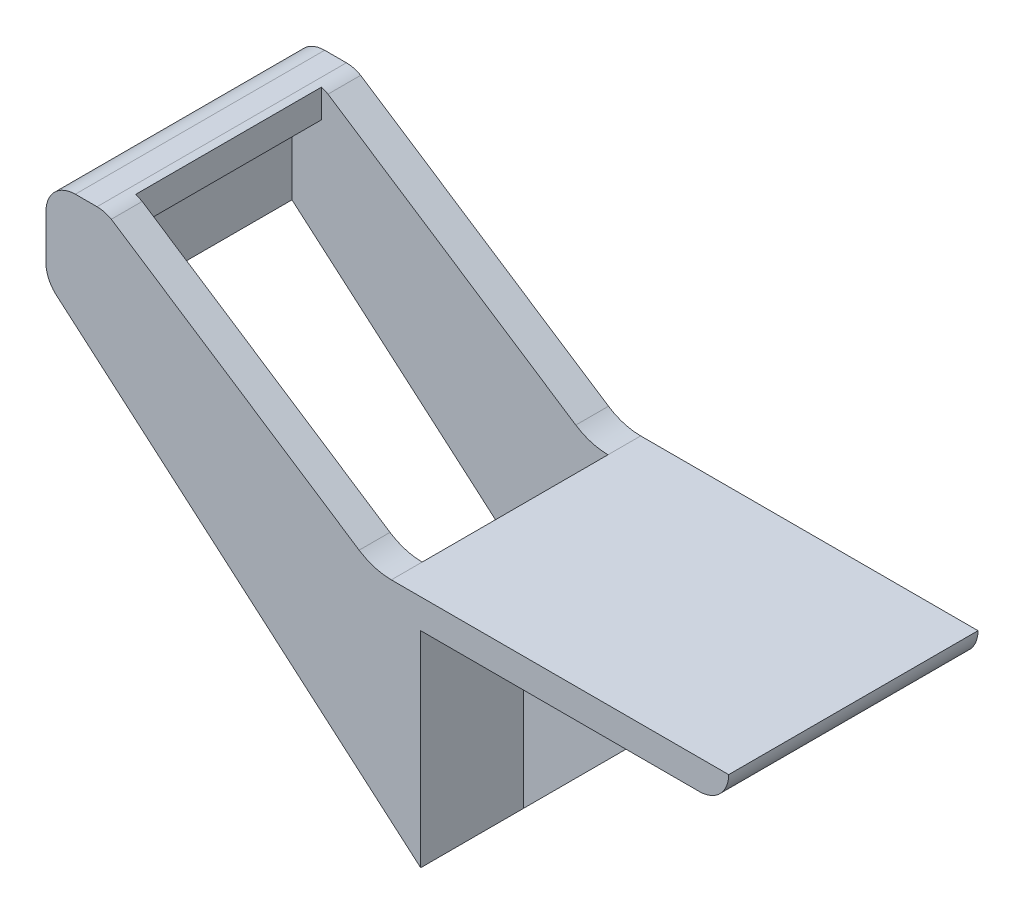
ISO-10303-21;
HEADER;
FILE_DESCRIPTION(('STEP AP214'),'2;1');
FILE_NAME('part.step','',(''),(''),'','','');
FILE_SCHEMA(('AUTOMOTIVE_DESIGN { 1 0 10303 214 1 1 1 1 }'));
ENDSEC;
DATA;
#1=APPLICATION_CONTEXT('core data for automotive mechanical design processes');
#2=APPLICATION_PROTOCOL_DEFINITION('international standard','automotive_design',2000,#1);
#3=PRODUCT_CONTEXT('',#1,'mechanical');
#4=PRODUCT('Part','Part','',(#3));
#5=PRODUCT_RELATED_PRODUCT_CATEGORY('part','',(#4));
#6=PRODUCT_DEFINITION_FORMATION('','',#4);
#7=PRODUCT_DEFINITION_CONTEXT('part definition',#1,'design');
#8=PRODUCT_DEFINITION('design','',#6,#7);
#9=PRODUCT_DEFINITION_SHAPE('','',#8);
#10=(LENGTH_UNIT() NAMED_UNIT(*) SI_UNIT(.MILLI.,.METRE.));
#11=(NAMED_UNIT(*) PLANE_ANGLE_UNIT() SI_UNIT($,.RADIAN.));
#12=(NAMED_UNIT(*) SI_UNIT($,.STERADIAN.) SOLID_ANGLE_UNIT());
#13=UNCERTAINTY_MEASURE_WITH_UNIT(LENGTH_MEASURE(1.E-05),#10,'distance_accuracy_value','');
#14=(GEOMETRIC_REPRESENTATION_CONTEXT(3) GLOBAL_UNCERTAINTY_ASSIGNED_CONTEXT((#13)) GLOBAL_UNIT_ASSIGNED_CONTEXT((#10,
#11,#12)) REPRESENTATION_CONTEXT('',''));
#15=CARTESIAN_POINT('',(0.,0.,0.));
#16=DIRECTION('',(0.,0.,1.));
#17=DIRECTION('',(1.,0.,0.));
#18=AXIS2_PLACEMENT_3D('',#15,#16,#17);
#19=CARTESIAN_POINT('',(0.,-6.35,26.9875));
#20=DIRECTION('',(1.,0.,0.));
#21=DIRECTION('',(0.,1.,0.));
#22=AXIS2_PLACEMENT_3D('',#19,#20,#21);
#23=PLANE('',#22);
#24=DIRECTION('',(0.,0.,-1.));
#25=VECTOR('',#24,1.);
#26=CARTESIAN_POINT('',(0.,-50.8,26.9875));
#27=LINE('',#26,#25);
#28=CARTESIAN_POINT('',(0.,-50.8,26.9875));
#29=VERTEX_POINT('',#28);
#30=CARTESIAN_POINT('',(0.,-50.8,4.7625));
#31=VERTEX_POINT('',#30);
#32=EDGE_CURVE('E343',#29,#31,#27,.T.);
#33=ORIENTED_EDGE('',*,*,#32,.T.);
#34=DIRECTION('',(0.,-1.,0.));
#35=VECTOR('',#34,1.);
#36=CARTESIAN_POINT('',(0.,-6.35,4.7625));
#37=LINE('',#36,#35);
#38=CARTESIAN_POINT('',(0.,-6.35,4.7625));
#39=VERTEX_POINT('',#38);
#40=EDGE_CURVE('E209',#39,#31,#37,.T.);
#41=ORIENTED_EDGE('',*,*,#40,.F.);
#42=DIRECTION('',(0.,0.,-1.));
#43=VECTOR('',#42,1.);
#44=CARTESIAN_POINT('',(0.,-6.35,26.9875));
#45=LINE('',#44,#43);
#46=CARTESIAN_POINT('',(0.,-6.35,26.9875));
#47=VERTEX_POINT('',#46);
#48=EDGE_CURVE('E346',#47,#39,#45,.T.);
#49=ORIENTED_EDGE('',*,*,#48,.F.);
#50=DIRECTION('',(0.,-1.,0.));
#51=VECTOR('',#50,1.);
#52=CARTESIAN_POINT('',(0.,-6.35,26.9875));
#53=LINE('',#52,#51);
#54=EDGE_CURVE('E284',#47,#29,#53,.T.);
#55=ORIENTED_EDGE('',*,*,#54,.T.);
#56=EDGE_LOOP('',(#33,#41,#49,#55));
#57=FACE_BOUND('',#56,.T.);
#58=ADVANCED_FACE('F35',(#57),#23,.T.);
#59=CARTESIAN_POINT('',(60.325,-6.35,26.9875));
#60=DIRECTION('',(0.,-1.,0.));
#61=DIRECTION('',(0.,0.,-1.));
#62=AXIS2_PLACEMENT_3D('',#59,#60,#61);
#63=PLANE('',#62);
#64=ORIENTED_EDGE('',*,*,#48,.T.);
#65=DIRECTION('',(-1.,0.,0.));
#66=VECTOR('',#65,1.);
#67=CARTESIAN_POINT('',(44.4499999999995,-6.35,4.7625));
#68=LINE('',#67,#66);
#69=CARTESIAN_POINT('',(44.4499999999995,-6.35,4.7625));
#70=VERTEX_POINT('',#69);
#71=EDGE_CURVE('E198',#70,#39,#68,.T.);
#72=ORIENTED_EDGE('',*,*,#71,.F.);
#73=DIRECTION('',(0.,0.,-1.));
#74=VECTOR('',#73,1.);
#75=CARTESIAN_POINT('',(44.4499999999995,-6.35,4.7625));
#76=LINE('',#75,#74);
#77=CARTESIAN_POINT('',(44.4499999999995,-6.35,-4.7625));
#78=VERTEX_POINT('',#77);
#79=EDGE_CURVE('E191',#70,#78,#76,.T.);
#80=ORIENTED_EDGE('',*,*,#79,.T.);
#81=DIRECTION('',(-1.,0.,0.));
#82=VECTOR('',#81,1.);
#83=CARTESIAN_POINT('',(44.4499999999995,-6.35,-4.7625));
#84=LINE('',#83,#82);
#85=CARTESIAN_POINT('',(0.,-6.35,-4.7625));
#86=VERTEX_POINT('',#85);
#87=EDGE_CURVE('E196',#78,#86,#84,.T.);
#88=ORIENTED_EDGE('',*,*,#87,.T.);
#89=CARTESIAN_POINT('',(0.,-6.35,-26.9875));
#90=VERTEX_POINT('',#89);
#91=EDGE_CURVE('E348',#86,#90,#45,.T.);
#92=ORIENTED_EDGE('',*,*,#91,.T.);
#93=DIRECTION('',(-1.,0.,0.));
#94=VECTOR('',#93,1.);
#95=CARTESIAN_POINT('',(60.325,-6.35,-26.9875));
#96=LINE('',#95,#94);
#97=CARTESIAN_POINT('',(60.325,-6.35,-26.9875));
#98=VERTEX_POINT('',#97);
#99=EDGE_CURVE('E312',#98,#90,#96,.T.);
#100=ORIENTED_EDGE('',*,*,#99,.F.);
#101=DIRECTION('',(0.,0.,-1.));
#102=VECTOR('',#101,1.);
#103=CARTESIAN_POINT('',(60.325,-6.35,26.9875));
#104=LINE('',#103,#102);
#105=CARTESIAN_POINT('',(60.325,-6.35,26.9875));
#106=VERTEX_POINT('',#105);
#107=EDGE_CURVE('E349',#106,#98,#104,.T.);
#108=ORIENTED_EDGE('',*,*,#107,.F.);
#109=DIRECTION('',(-1.,0.,0.));
#110=VECTOR('',#109,1.);
#111=CARTESIAN_POINT('',(60.325,-6.35,26.9875));
#112=LINE('',#111,#110);
#113=EDGE_CURVE('E281',#106,#47,#112,.T.);
#114=ORIENTED_EDGE('',*,*,#113,.T.);
#115=EDGE_LOOP('',(#64,#72,#80,#88,#92,#100,#108,#114));
#116=FACE_BOUND('',#115,.T.);
#117=ADVANCED_FACE('F194',(#116),#63,.T.);
#118=CARTESIAN_POINT('',(-78.9053255398063,17.1499853763291,26.9875));
#119=DIRECTION('',(0.65254371920983,0.757751076884621,0.));
#120=DIRECTION('',(-0.757751076884621,0.65254371920983,0.));
#121=AXIS2_PLACEMENT_3D('',#118,#119,#120);
#122=PLANE('',#121);
#123=DIRECTION('',(0.757751076884621,-0.65254371920983,0.));
#124=VECTOR('',#123,1.);
#125=CARTESIAN_POINT('',(-78.9053255398063,17.1499853763291,-26.9875));
#126=LINE('',#125,#124);
#127=CARTESIAN_POINT('',(-78.9053255398063,17.1499853763291,-26.9875));
#128=VERTEX_POINT('',#127);
#129=CARTESIAN_POINT('',(0.,-50.8,-26.9875));
#130=VERTEX_POINT('',#129);
#131=EDGE_CURVE('E318',#128,#130,#126,.T.);
#132=ORIENTED_EDGE('',*,*,#131,.T.);
#133=CARTESIAN_POINT('',(0.,-50.8,-4.7625));
#134=VERTEX_POINT('',#133);
#135=EDGE_CURVE('E345',#134,#130,#27,.T.);
#136=ORIENTED_EDGE('',*,*,#135,.F.);
#137=DIRECTION('',(0.,0.,-1.));
#138=VECTOR('',#137,1.);
#139=CARTESIAN_POINT('',(0.,-50.8,4.7625));
#140=LINE('',#139,#138);
#141=EDGE_CURVE('E57',#31,#134,#140,.T.);
#142=ORIENTED_EDGE('',*,*,#141,.F.);
#143=ORIENTED_EDGE('',*,*,#32,.F.);
#144=DIRECTION('',(0.757751076884621,-0.65254371920983,0.));
#145=VECTOR('',#144,1.);
#146=CARTESIAN_POINT('',(-78.9053255398063,17.1499853763291,26.9875));
#147=LINE('',#146,#145);
#148=CARTESIAN_POINT('',(-78.9053255398063,17.1499853763291,26.9875));
#149=VERTEX_POINT('',#148);
#150=EDGE_CURVE('E287',#149,#29,#147,.T.);
#151=ORIENTED_EDGE('',*,*,#150,.F.);
#152=DIRECTION('',(0.,0.,-1.));
#153=VECTOR('',#152,1.);
#154=CARTESIAN_POINT('',(-78.9053255398063,17.1499853763291,26.9875));
#155=LINE('',#154,#153);
#156=EDGE_CURVE('E340',#149,#128,#155,.T.);
#157=ORIENTED_EDGE('',*,*,#156,.T.);
#158=EDGE_LOOP('',(#132,#136,#142,#143,#151,#157));
#159=FACE_BOUND('',#158,.T.);
#160=DIRECTION('',(0.,0.,-1.));
#161=VECTOR('',#160,1.);
#162=CARTESIAN_POINT('',(-74.7616729228239,13.5816440406546,26.9875));
#163=LINE('',#162,#161);
#164=CARTESIAN_POINT('',(-74.7616729228239,13.5816440406546,20.3088969459393));
#165=VERTEX_POINT('',#164);
#166=CARTESIAN_POINT('',(-74.7616729228239,13.5816440406546,-19.9170854292975));
#167=VERTEX_POINT('',#166);
#168=EDGE_CURVE('E12',#165,#167,#163,.T.);
#169=ORIENTED_EDGE('',*,*,#168,.F.);
#170=DIRECTION('',(-0.757751076884621,0.65254371920983,0.));
#171=VECTOR('',#170,1.);
#172=CARTESIAN_POINT('',(-78.9053255398063,17.1499853763291,20.3088969459393));
#173=LINE('',#172,#171);
#174=CARTESIAN_POINT('',(-6.35000000000001,-45.3316440406546,20.3088969459393));
#175=VERTEX_POINT('',#174);
#176=EDGE_CURVE('E250',#175,#165,#173,.T.);
#177=ORIENTED_EDGE('',*,*,#176,.F.);
#178=DIRECTION('',(0.,0.,1.));
#179=VECTOR('',#178,1.);
#180=CARTESIAN_POINT('',(-6.34999999999999,-45.3316440406546,26.9875));
#181=LINE('',#180,#179);
#182=CARTESIAN_POINT('',(-6.35,-45.3316440406546,-19.9170854292975));
#183=VERTEX_POINT('',#182);
#184=EDGE_CURVE('E260',#183,#175,#181,.T.);
#185=ORIENTED_EDGE('',*,*,#184,.F.);
#186=DIRECTION('',(0.757751076884621,-0.65254371920983,0.));
#187=VECTOR('',#186,1.);
#188=CARTESIAN_POINT('',(-78.9053255398063,17.1499853763291,-19.9170854292975));
#189=LINE('',#188,#187);
#190=EDGE_CURVE('E258',#167,#183,#189,.T.);
#191=ORIENTED_EDGE('',*,*,#190,.F.);
#192=EDGE_LOOP('',(#169,#177,#185,#191));
#193=FACE_BOUND('',#192,.T.);
#194=ADVANCED_FACE('F403',(#159,#193),#122,.F.);
#195=CARTESIAN_POINT('',(-68.4116729228239,38.1,-19.9170854292975));
#196=DIRECTION('',(1.,0.,0.));
#197=DIRECTION('',(0.,0.,-1.));
#198=AXIS2_PLACEMENT_3D('',#195,#196,#197);
#199=PLANE('',#198);
#200=DIRECTION('',(0.,-1.,0.));
#201=VECTOR('',#200,1.);
#202=CARTESIAN_POINT('',(-68.4116729228239,38.1,20.3088969459393));
#203=LINE('',#202,#201);
#204=CARTESIAN_POINT('',(-68.4116729228239,37.8821561526516,20.3088969459393));
#205=VERTEX_POINT('',#204);
#206=CARTESIAN_POINT('',(-68.4116729228239,31.75,20.3088969459393));
#207=VERTEX_POINT('',#206);
#208=EDGE_CURVE('E235',#205,#207,#203,.T.);
#209=ORIENTED_EDGE('',*,*,#208,.T.);
#210=DIRECTION('',(0.,0.,1.));
#211=VECTOR('',#210,1.);
#212=CARTESIAN_POINT('',(-68.4116729228239,31.75,-19.9170854292975));
#213=LINE('',#212,#211);
#214=CARTESIAN_POINT('',(-68.4116729228239,31.75,-19.9170854292975));
#215=VERTEX_POINT('',#214);
#216=EDGE_CURVE('E224',#215,#207,#213,.T.);
#217=ORIENTED_EDGE('',*,*,#216,.F.);
#218=DIRECTION('',(0.,-1.,0.));
#219=VECTOR('',#218,1.);
#220=CARTESIAN_POINT('',(-68.4116729228239,38.1,-19.9170854292975));
#221=LINE('',#220,#219);
#222=CARTESIAN_POINT('',(-68.4116729228239,37.8821561526516,-19.9170854292975));
#223=VERTEX_POINT('',#222);
#224=EDGE_CURVE('E238',#223,#215,#221,.T.);
#225=ORIENTED_EDGE('',*,*,#224,.F.);
#226=DIRECTION('',(0.,0.,-1.));
#227=VECTOR('',#226,1.);
#228=CARTESIAN_POINT('',(-68.4116729228239,37.8821561526516,26.9875));
#229=LINE('',#228,#227);
#230=EDGE_CURVE('E263',#205,#223,#229,.T.);
#231=ORIENTED_EDGE('',*,*,#230,.F.);
#232=EDGE_LOOP('',(#209,#217,#225,#231));
#233=FACE_BOUND('',#232,.T.);
#234=ADVANCED_FACE('F389',(#233),#199,.T.);
#235=CARTESIAN_POINT('',(-70.0606607698069,31.75,26.9875));
#236=DIRECTION('',(0.,0.,-1.));
#237=DIRECTION('',(-1.,0.,0.));
#238=AXIS2_PLACEMENT_3D('',#235,#236,#237);
#239=CYLINDRICAL_SURFACE('',#238,6.35);
#240=ORIENTED_EDGE('',*,*,#230,.T.);
#241=CARTESIAN_POINT('',(-70.0606607698069,31.75,-19.9170854292975));
#242=DIRECTION('',(0.,0.,1.));
#243=DIRECTION('',(1.,0.,0.));
#244=AXIS2_PLACEMENT_3D('',#241,#242,#243);
#245=CIRCLE('',#244,6.35);
#246=CARTESIAN_POINT('',(-66.9710349961021,37.2976763224308,-19.9170854292975));
#247=VERTEX_POINT('',#246);
#248=EDGE_CURVE('E255',#223,#247,#245,.F.);
#249=ORIENTED_EDGE('',*,*,#248,.T.);
#250=DIRECTION('',(0.,0.,-1.));
#251=VECTOR('',#250,1.);
#252=CARTESIAN_POINT('',(-66.9710349961021,37.2976763224308,26.9875));
#253=LINE('',#252,#251);
#254=CARTESIAN_POINT('',(-66.9710349961021,37.2976763224308,-26.9875));
#255=VERTEX_POINT('',#254);
#256=EDGE_CURVE('E298',#247,#255,#253,.T.);
#257=ORIENTED_EDGE('',*,*,#256,.T.);
#258=CARTESIAN_POINT('',(-70.0606607698069,31.75,-26.9875));
#259=DIRECTION('',(0.,0.,-1.));
#260=DIRECTION('',(-1.,0.,0.));
#261=AXIS2_PLACEMENT_3D('',#258,#259,#260);
#262=CIRCLE('',#261,6.35);
#263=CARTESIAN_POINT('',(-70.0606607698069,38.1,-26.9875));
#264=VERTEX_POINT('',#263);
#265=EDGE_CURVE('E266',#264,#255,#262,.T.);
#266=ORIENTED_EDGE('',*,*,#265,.F.);
#267=DIRECTION('',(0.,0.,-1.));
#268=VECTOR('',#267,1.);
#269=CARTESIAN_POINT('',(-70.0606607698069,38.1,26.9875));
#270=LINE('',#269,#268);
#271=CARTESIAN_POINT('',(-70.0606607698069,38.1,26.9875));
#272=VERTEX_POINT('',#271);
#273=EDGE_CURVE('E330',#272,#264,#270,.T.);
#274=ORIENTED_EDGE('',*,*,#273,.F.);
#275=CARTESIAN_POINT('',(-70.0606607698069,31.75,26.9875));
#276=DIRECTION('',(0.,0.,-1.));
#277=DIRECTION('',(-1.,0.,0.));
#278=AXIS2_PLACEMENT_3D('',#275,#276,#277);
#279=CIRCLE('',#278,6.35);
#280=CARTESIAN_POINT('',(-66.9710349961021,37.2976763224308,26.9875));
#281=VERTEX_POINT('',#280);
#282=EDGE_CURVE('E267',#272,#281,#279,.T.);
#283=ORIENTED_EDGE('',*,*,#282,.T.);
#284=CARTESIAN_POINT('',(-66.9710349961021,37.2976763224308,20.3088969459393));
#285=VERTEX_POINT('',#284);
#286=EDGE_CURVE('E363',#281,#285,#253,.T.);
#287=ORIENTED_EDGE('',*,*,#286,.T.);
#288=CARTESIAN_POINT('',(-70.0606607698069,31.75,20.3088969459393));
#289=DIRECTION('',(0.,0.,-1.));
#290=DIRECTION('',(-1.,0.,0.));
#291=AXIS2_PLACEMENT_3D('',#288,#289,#290);
#292=CIRCLE('',#291,6.35);
#293=EDGE_CURVE('E247',#285,#205,#292,.F.);
#294=ORIENTED_EDGE('',*,*,#293,.T.);
#295=EDGE_LOOP('',(#240,#249,#257,#266,#274,#283,#287,#294));
#296=FACE_BOUND('',#295,.T.);
#297=ADVANCED_FACE('F37',(#296),#239,.T.);
#298=CARTESIAN_POINT('',(-6.34999999999999,12.7,26.9875));
#299=DIRECTION('',(0.,0.,-1.));
#300=DIRECTION('',(-1.,0.,0.));
#301=AXIS2_PLACEMENT_3D('',#298,#299,#300);
#302=CYLINDRICAL_SURFACE('',#301,12.7);
#303=DIRECTION('',(0.,0.,-1.));
#304=VECTOR('',#303,1.);
#305=CARTESIAN_POINT('',(-13.3187167882357,2.08270343612074,26.9875));
#306=LINE('',#305,#304);
#307=CARTESIAN_POINT('',(-13.3187167882357,2.08270343612074,-19.9170854292975));
#308=VERTEX_POINT('',#307);
#309=CARTESIAN_POINT('',(-13.3187167882357,2.08270343612074,-26.9875));
#310=VERTEX_POINT('',#309);
#311=EDGE_CURVE('E362',#308,#310,#306,.T.);
#312=ORIENTED_EDGE('',*,*,#311,.F.);
#313=CARTESIAN_POINT('',(-6.34999999999999,12.7,-19.9170854292975));
#314=DIRECTION('',(0.,0.,1.));
#315=DIRECTION('',(1.,0.,0.));
#316=AXIS2_PLACEMENT_3D('',#313,#314,#315);
#317=CIRCLE('',#316,12.7);
#318=CARTESIAN_POINT('',(-6.34999999999999,0.,-19.9170854292975));
#319=VERTEX_POINT('',#318);
#320=EDGE_CURVE('E252',#308,#319,#317,.T.);
#321=ORIENTED_EDGE('',*,*,#320,.T.);
#322=DIRECTION('',(0.,0.,-1.));
#323=VECTOR('',#322,1.);
#324=CARTESIAN_POINT('',(-6.35,0.,26.9875));
#325=LINE('',#324,#323);
#326=CARTESIAN_POINT('',(-6.35,0.,-26.9875));
#327=VERTEX_POINT('',#326);
#328=EDGE_CURVE('E358',#319,#327,#325,.T.);
#329=ORIENTED_EDGE('',*,*,#328,.T.);
#330=CARTESIAN_POINT('',(-6.34999999999999,12.7,-26.9875));
#331=DIRECTION('',(0.,0.,1.));
#332=DIRECTION('',(1.,0.,0.));
#333=AXIS2_PLACEMENT_3D('',#330,#331,#332);
#334=CIRCLE('',#333,12.7);
#335=EDGE_CURVE('E304',#310,#327,#334,.T.);
#336=ORIENTED_EDGE('',*,*,#335,.F.);
#337=EDGE_LOOP('',(#312,#321,#329,#336));
#338=FACE_BOUND('',#337,.T.);
#339=ADVANCED_FACE('F376',(#338),#302,.F.);
#340=CARTESIAN_POINT('',(-6.35,0.,26.9875));
#341=VERTEX_POINT('',#340);
#342=CARTESIAN_POINT('',(-6.34999999999999,0.,20.3088969459393));
#343=VERTEX_POINT('',#342);
#344=EDGE_CURVE('E354',#341,#343,#325,.T.);
#345=ORIENTED_EDGE('',*,*,#344,.T.);
#346=CARTESIAN_POINT('',(-6.34999999999999,12.7,20.3088969459393));
#347=DIRECTION('',(0.,0.,-1.));
#348=DIRECTION('',(-1.,0.,0.));
#349=AXIS2_PLACEMENT_3D('',#346,#347,#348);
#350=CIRCLE('',#349,12.7);
#351=CARTESIAN_POINT('',(-13.3187167882357,2.08270343612074,20.3088969459393));
#352=VERTEX_POINT('',#351);
#353=EDGE_CURVE('E244',#343,#352,#350,.T.);
#354=ORIENTED_EDGE('',*,*,#353,.T.);
#355=CARTESIAN_POINT('',(-13.3187167882357,2.08270343612074,26.9875));
#356=VERTEX_POINT('',#355);
#357=EDGE_CURVE('E359',#356,#352,#306,.T.);
#358=ORIENTED_EDGE('',*,*,#357,.F.);
#359=CARTESIAN_POINT('',(-6.34999999999999,12.7,26.9875));
#360=DIRECTION('',(0.,0.,1.));
#361=DIRECTION('',(1.,0.,0.));
#362=AXIS2_PLACEMENT_3D('',#359,#360,#361);
#363=CIRCLE('',#362,12.7);
#364=EDGE_CURVE('E274',#356,#341,#363,.T.);
#365=ORIENTED_EDGE('',*,*,#364,.T.);
#366=EDGE_LOOP('',(#345,#354,#358,#365));
#367=FACE_BOUND('',#366,.T.);
#368=ADVANCED_FACE('F415',(#367),#302,.F.);
#369=CARTESIAN_POINT('',(-66.9710349961021,37.2976763224308,26.9875));
#370=DIRECTION('',(0.548717857341391,0.83600760345506,0.));
#371=DIRECTION('',(-0.83600760345506,0.548717857341391,0.));
#372=AXIS2_PLACEMENT_3D('',#369,#370,#371);
#373=PLANE('',#372);
#374=ORIENTED_EDGE('',*,*,#256,.F.);
#375=DIRECTION('',(0.83600760345506,-0.548717857341391,0.));
#376=VECTOR('',#375,1.);
#377=CARTESIAN_POINT('',(-66.9710349961021,37.2976763224308,-19.9170854292975));
#378=LINE('',#377,#376);
#379=EDGE_CURVE('E43',#247,#308,#378,.T.);
#380=ORIENTED_EDGE('',*,*,#379,.T.);
#381=ORIENTED_EDGE('',*,*,#311,.T.);
#382=DIRECTION('',(0.83600760345506,-0.548717857341391,0.));
#383=VECTOR('',#382,1.);
#384=CARTESIAN_POINT('',(-66.9710349961021,37.2976763224308,-26.9875));
#385=LINE('',#384,#383);
#386=EDGE_CURVE('E301',#255,#310,#385,.T.);
#387=ORIENTED_EDGE('',*,*,#386,.F.);
#388=EDGE_LOOP('',(#374,#380,#381,#387));
#389=FACE_BOUND('',#388,.T.);
#390=ADVANCED_FACE('F371',(#389),#373,.T.);
#391=ORIENTED_EDGE('',*,*,#357,.T.);
#392=DIRECTION('',(-0.83600760345506,0.548717857341391,0.));
#393=VECTOR('',#392,1.);
#394=CARTESIAN_POINT('',(-66.9710349961021,37.2976763224308,20.3088969459393));
#395=LINE('',#394,#393);
#396=EDGE_CURVE('E332',#352,#285,#395,.T.);
#397=ORIENTED_EDGE('',*,*,#396,.T.);
#398=ORIENTED_EDGE('',*,*,#286,.F.);
#399=DIRECTION('',(0.83600760345506,-0.548717857341391,0.));
#400=VECTOR('',#399,1.);
#401=CARTESIAN_POINT('',(-66.9710349961021,37.2976763224308,26.9875));
#402=LINE('',#401,#400);
#403=EDGE_CURVE('E270',#281,#356,#402,.T.);
#404=ORIENTED_EDGE('',*,*,#403,.T.);
#405=EDGE_LOOP('',(#391,#397,#398,#404));
#406=FACE_BOUND('',#405,.T.);
#407=ADVANCED_FACE('F422',(#406),#373,.T.);
#408=CARTESIAN_POINT('',(-70.0606607698069,38.1,26.9875));
#409=DIRECTION('',(0.,-1.,0.));
#410=DIRECTION('',(0.,0.,-1.));
#411=AXIS2_PLACEMENT_3D('',#408,#409,#410);
#412=PLANE('',#411);
#413=DIRECTION('',(-1.,0.,0.));
#414=VECTOR('',#413,1.);
#415=CARTESIAN_POINT('',(-70.0606607698069,38.1,-26.9875));
#416=LINE('',#415,#414);
#417=CARTESIAN_POINT('',(-74.7616729228239,38.1,-26.9875));
#418=VERTEX_POINT('',#417);
#419=EDGE_CURVE('E271',#264,#418,#416,.T.);
#420=ORIENTED_EDGE('',*,*,#419,.T.);
#421=DIRECTION('',(0.,0.,-1.));
#422=VECTOR('',#421,1.);
#423=CARTESIAN_POINT('',(-74.7616729228239,38.1,26.9875));
#424=LINE('',#423,#422);
#425=CARTESIAN_POINT('',(-74.7616729228239,38.1,26.9875));
#426=VERTEX_POINT('',#425);
#427=EDGE_CURVE('E333',#426,#418,#424,.T.);
#428=ORIENTED_EDGE('',*,*,#427,.F.);
#429=DIRECTION('',(-1.,0.,0.));
#430=VECTOR('',#429,1.);
#431=CARTESIAN_POINT('',(-70.0606607698069,38.1,26.9875));
#432=LINE('',#431,#430);
#433=EDGE_CURVE('E296',#272,#426,#432,.T.);
#434=ORIENTED_EDGE('',*,*,#433,.F.);
#435=ORIENTED_EDGE('',*,*,#273,.T.);
#436=EDGE_LOOP('',(#420,#428,#434,#435));
#437=FACE_BOUND('',#436,.T.);
#438=ADVANCED_FACE('F426',(#437),#412,.F.);
#439=CARTESIAN_POINT('',(-74.7616729228239,31.75,26.9875));
#440=DIRECTION('',(0.,0.,-1.));
#441=DIRECTION('',(-1.,0.,0.));
#442=AXIS2_PLACEMENT_3D('',#439,#440,#441);
#443=CYLINDRICAL_SURFACE('',#442,6.35);
#444=CARTESIAN_POINT('',(-74.7616729228239,31.75,-26.9875));
#445=DIRECTION('',(0.,0.,-1.));
#446=DIRECTION('',(-1.,0.,0.));
#447=AXIS2_PLACEMENT_3D('',#444,#445,#446);
#448=CIRCLE('',#447,6.35);
#449=CARTESIAN_POINT('',(-81.1116729228239,31.75,-26.9875));
#450=VERTEX_POINT('',#449);
#451=EDGE_CURVE('E325',#450,#418,#448,.T.);
#452=ORIENTED_EDGE('',*,*,#451,.F.);
#453=DIRECTION('',(0.,0.,-1.));
#454=VECTOR('',#453,1.);
#455=CARTESIAN_POINT('',(-81.1116729228239,31.75,26.9875));
#456=LINE('',#455,#454);
#457=CARTESIAN_POINT('',(-81.1116729228239,31.75,26.9875));
#458=VERTEX_POINT('',#457);
#459=EDGE_CURVE('E335',#458,#450,#456,.T.);
#460=ORIENTED_EDGE('',*,*,#459,.F.);
#461=CARTESIAN_POINT('',(-74.7616729228239,31.75,26.9875));
#462=DIRECTION('',(0.,0.,-1.));
#463=DIRECTION('',(-1.,0.,0.));
#464=AXIS2_PLACEMENT_3D('',#461,#462,#463);
#465=CIRCLE('',#464,6.35);
#466=EDGE_CURVE('E293',#458,#426,#465,.T.);
#467=ORIENTED_EDGE('',*,*,#466,.T.);
#468=ORIENTED_EDGE('',*,*,#427,.T.);
#469=EDGE_LOOP('',(#452,#460,#467,#468));
#470=FACE_BOUND('',#469,.T.);
#471=ADVANCED_FACE('F429',(#470),#443,.T.);
#472=CARTESIAN_POINT('',(-81.1116729228239,31.75,26.9875));
#473=DIRECTION('',(1.,0.,0.));
#474=DIRECTION('',(0.,0.,-1.));
#475=AXIS2_PLACEMENT_3D('',#472,#473,#474);
#476=PLANE('',#475);
#477=DIRECTION('',(0.,-1.,0.));
#478=VECTOR('',#477,1.);
#479=CARTESIAN_POINT('',(-81.1116729228239,31.75,-26.9875));
#480=LINE('',#479,#478);
#481=CARTESIAN_POINT('',(-81.1116729228239,21.9617047145464,-26.9875));
#482=VERTEX_POINT('',#481);
#483=EDGE_CURVE('E323',#450,#482,#480,.T.);
#484=ORIENTED_EDGE('',*,*,#483,.T.);
#485=DIRECTION('',(0.,0.,-1.));
#486=VECTOR('',#485,1.);
#487=CARTESIAN_POINT('',(-81.1116729228239,21.9617047145464,26.9875));
#488=LINE('',#487,#486);
#489=CARTESIAN_POINT('',(-81.1116729228239,21.9617047145464,26.9875));
#490=VERTEX_POINT('',#489);
#491=EDGE_CURVE('E337',#490,#482,#488,.T.);
#492=ORIENTED_EDGE('',*,*,#491,.F.);
#493=DIRECTION('',(0.,-1.,0.));
#494=VECTOR('',#493,1.);
#495=CARTESIAN_POINT('',(-81.1116729228239,31.75,26.9875));
#496=LINE('',#495,#494);
#497=EDGE_CURVE('E291',#458,#490,#496,.T.);
#498=ORIENTED_EDGE('',*,*,#497,.F.);
#499=ORIENTED_EDGE('',*,*,#459,.T.);
#500=EDGE_LOOP('',(#484,#492,#498,#499));
#501=FACE_BOUND('',#500,.T.);
#502=ADVANCED_FACE('F434',(#501),#476,.F.);
#503=CARTESIAN_POINT('',(-74.7616729228239,21.9617047145464,26.9875));
#504=DIRECTION('',(0.,0.,-1.));
#505=DIRECTION('',(-1.,0.,0.));
#506=AXIS2_PLACEMENT_3D('',#503,#504,#505);
#507=CYLINDRICAL_SURFACE('',#506,6.34999999999999);
#508=CARTESIAN_POINT('',(-74.7616729228239,21.9617047145464,-26.9875));
#509=DIRECTION('',(0.,0.,1.));
#510=DIRECTION('',(1.,0.,0.));
#511=AXIS2_PLACEMENT_3D('',#508,#509,#510);
#512=CIRCLE('',#511,6.34999999999999);
#513=EDGE_CURVE('E321',#482,#128,#512,.T.);
#514=ORIENTED_EDGE('',*,*,#513,.T.);
#515=ORIENTED_EDGE('',*,*,#156,.F.);
#516=CARTESIAN_POINT('',(-74.7616729228239,21.9617047145464,26.9875));
#517=DIRECTION('',(0.,0.,1.));
#518=DIRECTION('',(1.,0.,0.));
#519=AXIS2_PLACEMENT_3D('',#516,#517,#518);
#520=CIRCLE('',#519,6.34999999999999);
#521=EDGE_CURVE('E289',#490,#149,#520,.T.);
#522=ORIENTED_EDGE('',*,*,#521,.F.);
#523=ORIENTED_EDGE('',*,*,#491,.T.);
#524=EDGE_LOOP('',(#514,#515,#522,#523));
#525=FACE_BOUND('',#524,.T.);
#526=ADVANCED_FACE('F440',(#525),#507,.T.);
#527=DIRECTION('',(0.,-1.,0.));
#528=VECTOR('',#527,1.);
#529=CARTESIAN_POINT('',(0.,-6.35,-4.7625));
#530=LINE('',#529,#528);
#531=EDGE_CURVE('E50',#86,#134,#530,.T.);
#532=ORIENTED_EDGE('',*,*,#531,.T.);
#533=ORIENTED_EDGE('',*,*,#135,.T.);
#534=DIRECTION('',(0.,-1.,0.));
#535=VECTOR('',#534,1.);
#536=CARTESIAN_POINT('',(0.,-6.35,-26.9875));
#537=LINE('',#536,#535);
#538=EDGE_CURVE('E315',#90,#130,#537,.T.);
#539=ORIENTED_EDGE('',*,*,#538,.F.);
#540=ORIENTED_EDGE('',*,*,#91,.F.);
#541=EDGE_LOOP('',(#532,#533,#539,#540));
#542=FACE_BOUND('',#541,.T.);
#543=ADVANCED_FACE('F452',(#542),#23,.T.);
#544=CARTESIAN_POINT('',(60.325,0.,26.9875));
#545=DIRECTION('',(0.,0.,-1.));
#546=DIRECTION('',(-1.,0.,0.));
#547=AXIS2_PLACEMENT_3D('',#544,#545,#546);
#548=CYLINDRICAL_SURFACE('',#547,6.35);
#549=CARTESIAN_POINT('',(60.325,0.,-26.9875));
#550=DIRECTION('',(0.,0.,1.));
#551=DIRECTION('',(1.,0.,0.));
#552=AXIS2_PLACEMENT_3D('',#549,#550,#551);
#553=CIRCLE('',#552,6.35);
#554=CARTESIAN_POINT('',(66.675,0.,-26.9875));
#555=VERTEX_POINT('',#554);
#556=EDGE_CURVE('E310',#98,#555,#553,.T.);
#557=ORIENTED_EDGE('',*,*,#556,.T.);
#558=DIRECTION('',(0.,0.,-1.));
#559=VECTOR('',#558,1.);
#560=CARTESIAN_POINT('',(66.675,0.,26.9875));
#561=LINE('',#560,#559);
#562=CARTESIAN_POINT('',(66.675,0.,26.9875));
#563=VERTEX_POINT('',#562);
#564=EDGE_CURVE('E351',#563,#555,#561,.T.);
#565=ORIENTED_EDGE('',*,*,#564,.F.);
#566=CARTESIAN_POINT('',(60.325,0.,26.9875));
#567=DIRECTION('',(0.,0.,1.));
#568=DIRECTION('',(1.,0.,0.));
#569=AXIS2_PLACEMENT_3D('',#566,#567,#568);
#570=CIRCLE('',#569,6.35);
#571=EDGE_CURVE('E279',#106,#563,#570,.T.);
#572=ORIENTED_EDGE('',*,*,#571,.F.);
#573=ORIENTED_EDGE('',*,*,#107,.T.);
#574=EDGE_LOOP('',(#557,#565,#572,#573));
#575=FACE_BOUND('',#574,.T.);
#576=ADVANCED_FACE('F450',(#575),#548,.T.);
#577=CARTESIAN_POINT('',(66.675,0.,26.9875));
#578=DIRECTION('',(0.,-1.,0.));
#579=DIRECTION('',(1.,0.,0.));
#580=AXIS2_PLACEMENT_3D('',#577,#578,#579);
#581=PLANE('',#580);
#582=DIRECTION('',(-1.,0.,0.));
#583=VECTOR('',#582,1.);
#584=CARTESIAN_POINT('',(66.675,0.,-26.9875));
#585=LINE('',#584,#583);
#586=EDGE_CURVE('E307',#555,#327,#585,.T.);
#587=ORIENTED_EDGE('',*,*,#586,.T.);
#588=ORIENTED_EDGE('',*,*,#328,.F.);
#589=EDGE_CURVE('E357',#343,#319,#325,.T.);
#590=ORIENTED_EDGE('',*,*,#589,.F.);
#591=ORIENTED_EDGE('',*,*,#344,.F.);
#592=DIRECTION('',(-1.,0.,0.));
#593=VECTOR('',#592,1.);
#594=CARTESIAN_POINT('',(66.675,0.,26.9875));
#595=LINE('',#594,#593);
#596=EDGE_CURVE('E277',#563,#341,#595,.T.);
#597=ORIENTED_EDGE('',*,*,#596,.F.);
#598=ORIENTED_EDGE('',*,*,#564,.T.);
#599=EDGE_LOOP('',(#587,#588,#590,#591,#597,#598));
#600=FACE_BOUND('',#599,.T.);
#601=ADVANCED_FACE('F412',(#600),#581,.F.);
#602=CARTESIAN_POINT('',(-70.0606607698069,31.75,26.9875));
#603=DIRECTION('',(0.,0.,-1.));
#604=DIRECTION('',(-1.,0.,0.));
#605=AXIS2_PLACEMENT_3D('',#602,#603,#604);
#606=PLANE('',#605);
#607=ORIENTED_EDGE('',*,*,#282,.F.);
#608=ORIENTED_EDGE('',*,*,#433,.T.);
#609=ORIENTED_EDGE('',*,*,#466,.F.);
#610=ORIENTED_EDGE('',*,*,#497,.T.);
#611=ORIENTED_EDGE('',*,*,#521,.T.);
#612=ORIENTED_EDGE('',*,*,#150,.T.);
#613=ORIENTED_EDGE('',*,*,#54,.F.);
#614=ORIENTED_EDGE('',*,*,#113,.F.);
#615=ORIENTED_EDGE('',*,*,#571,.T.);
#616=ORIENTED_EDGE('',*,*,#596,.T.);
#617=ORIENTED_EDGE('',*,*,#364,.F.);
#618=ORIENTED_EDGE('',*,*,#403,.F.);
#619=EDGE_LOOP('',(#607,#608,#609,#610,#611,#612,#613,#614,#615,#616,#617,#618));
#620=FACE_BOUND('',#619,.T.);
#621=ADVANCED_FACE('F420',(#620),#606,.F.);
#622=CARTESIAN_POINT('',(-70.0606607698069,31.75,-26.9875));
#623=DIRECTION('',(0.,0.,-1.));
#624=DIRECTION('',(-1.,0.,0.));
#625=AXIS2_PLACEMENT_3D('',#622,#623,#624);
#626=PLANE('',#625);
#627=ORIENTED_EDGE('',*,*,#265,.T.);
#628=ORIENTED_EDGE('',*,*,#386,.T.);
#629=ORIENTED_EDGE('',*,*,#335,.T.);
#630=ORIENTED_EDGE('',*,*,#586,.F.);
#631=ORIENTED_EDGE('',*,*,#556,.F.);
#632=ORIENTED_EDGE('',*,*,#99,.T.);
#633=ORIENTED_EDGE('',*,*,#538,.T.);
#634=ORIENTED_EDGE('',*,*,#131,.F.);
#635=ORIENTED_EDGE('',*,*,#513,.F.);
#636=ORIENTED_EDGE('',*,*,#483,.F.);
#637=ORIENTED_EDGE('',*,*,#451,.T.);
#638=ORIENTED_EDGE('',*,*,#419,.F.);
#639=EDGE_LOOP('',(#627,#628,#629,#630,#631,#632,#633,#634,#635,#636,#637,#638));
#640=FACE_BOUND('',#639,.T.);
#641=ADVANCED_FACE('F380',(#640),#626,.T.);
#642=CARTESIAN_POINT('',(-6.34999999999999,38.1,-19.9170854292975));
#643=DIRECTION('',(-1.,0.,0.));
#644=DIRECTION('',(0.,0.,1.));
#645=AXIS2_PLACEMENT_3D('',#642,#643,#644);
#646=PLANE('',#645);
#647=ORIENTED_EDGE('',*,*,#184,.T.);
#648=DIRECTION('',(0.,-1.,0.));
#649=VECTOR('',#648,1.);
#650=CARTESIAN_POINT('',(-6.34999999999999,38.1,20.3088969459393));
#651=LINE('',#650,#649);
#652=EDGE_CURVE('E226',#343,#175,#651,.T.);
#653=ORIENTED_EDGE('',*,*,#652,.F.);
#654=ORIENTED_EDGE('',*,*,#589,.T.);
#655=DIRECTION('',(0.,-1.,0.));
#656=VECTOR('',#655,1.);
#657=CARTESIAN_POINT('',(-6.34999999999999,38.1,-19.9170854292975));
#658=LINE('',#657,#656);
#659=EDGE_CURVE('E241',#319,#183,#658,.T.);
#660=ORIENTED_EDGE('',*,*,#659,.T.);
#661=EDGE_LOOP('',(#647,#653,#654,#660));
#662=FACE_BOUND('',#661,.T.);
#663=ADVANCED_FACE('F407',(#662),#646,.T.);
#664=CARTESIAN_POINT('',(-6.34999999999999,38.1,-19.9170854292975));
#665=DIRECTION('',(0.,0.,1.));
#666=DIRECTION('',(1.,0.,0.));
#667=AXIS2_PLACEMENT_3D('',#664,#665,#666);
#668=PLANE('',#667);
#669=ORIENTED_EDGE('',*,*,#190,.T.);
#670=ORIENTED_EDGE('',*,*,#659,.F.);
#671=ORIENTED_EDGE('',*,*,#320,.F.);
#672=ORIENTED_EDGE('',*,*,#379,.F.);
#673=ORIENTED_EDGE('',*,*,#248,.F.);
#674=ORIENTED_EDGE('',*,*,#224,.T.);
#675=DIRECTION('',(1.,0.,0.));
#676=VECTOR('',#675,1.);
#677=CARTESIAN_POINT('',(-68.4116729228239,31.75,-19.9170854292975));
#678=LINE('',#677,#676);
#679=CARTESIAN_POINT('',(-74.7616729228239,31.75,-19.9170854292975));
#680=VERTEX_POINT('',#679);
#681=EDGE_CURVE('E221',#680,#215,#678,.T.);
#682=ORIENTED_EDGE('',*,*,#681,.F.);
#683=DIRECTION('',(0.,-1.,0.));
#684=VECTOR('',#683,1.);
#685=CARTESIAN_POINT('',(-74.7616729228239,78.8240980017098,-19.9170854292975));
#686=LINE('',#685,#684);
#687=EDGE_CURVE('E229',#680,#167,#686,.T.);
#688=ORIENTED_EDGE('',*,*,#687,.T.);
#689=EDGE_LOOP('',(#669,#670,#671,#672,#673,#674,#682,#688));
#690=FACE_BOUND('',#689,.T.);
#691=ADVANCED_FACE('F386',(#690),#668,.T.);
#692=CARTESIAN_POINT('',(-6.34999999999999,38.1,20.3088969459393));
#693=DIRECTION('',(0.,0.,-1.));
#694=DIRECTION('',(-1.,0.,0.));
#695=AXIS2_PLACEMENT_3D('',#692,#693,#694);
#696=PLANE('',#695);
#697=ORIENTED_EDGE('',*,*,#176,.T.);
#698=DIRECTION('',(0.,-1.,0.));
#699=VECTOR('',#698,1.);
#700=CARTESIAN_POINT('',(-74.7616729228239,78.8240980017098,20.3088969459393));
#701=LINE('',#700,#699);
#702=CARTESIAN_POINT('',(-74.7616729228239,31.75,20.3088969459393));
#703=VERTEX_POINT('',#702);
#704=EDGE_CURVE('E217',#703,#165,#701,.T.);
#705=ORIENTED_EDGE('',*,*,#704,.F.);
#706=DIRECTION('',(-1.,0.,0.));
#707=VECTOR('',#706,1.);
#708=CARTESIAN_POINT('',(-68.4116729228239,31.75,20.3088969459393));
#709=LINE('',#708,#707);
#710=EDGE_CURVE('E222',#207,#703,#709,.T.);
#711=ORIENTED_EDGE('',*,*,#710,.F.);
#712=ORIENTED_EDGE('',*,*,#208,.F.);
#713=ORIENTED_EDGE('',*,*,#293,.F.);
#714=ORIENTED_EDGE('',*,*,#396,.F.);
#715=ORIENTED_EDGE('',*,*,#353,.F.);
#716=ORIENTED_EDGE('',*,*,#652,.T.);
#717=EDGE_LOOP('',(#697,#705,#711,#712,#713,#714,#715,#716));
#718=FACE_BOUND('',#717,.T.);
#719=ADVANCED_FACE('F396',(#718),#696,.T.);
#720=CARTESIAN_POINT('',(-74.7616729228239,78.8240980017098,-19.9170854292975));
#721=DIRECTION('',(1.,0.,0.));
#722=DIRECTION('',(0.,0.,-1.));
#723=AXIS2_PLACEMENT_3D('',#720,#721,#722);
#724=PLANE('',#723);
#725=ORIENTED_EDGE('',*,*,#168,.T.);
#726=ORIENTED_EDGE('',*,*,#687,.F.);
#727=DIRECTION('',(0.,0.,-1.));
#728=VECTOR('',#727,1.);
#729=CARTESIAN_POINT('',(-74.7616729228239,31.75,-19.9170854292975));
#730=LINE('',#729,#728);
#731=EDGE_CURVE('E218',#703,#680,#730,.T.);
#732=ORIENTED_EDGE('',*,*,#731,.F.);
#733=ORIENTED_EDGE('',*,*,#704,.T.);
#734=EDGE_LOOP('',(#725,#726,#732,#733));
#735=FACE_BOUND('',#734,.T.);
#736=ADVANCED_FACE('F400',(#735),#724,.T.);
#737=CARTESIAN_POINT('',(-70.0606607698069,31.75,26.9875));
#738=DIRECTION('',(0.,-1.,0.));
#739=DIRECTION('',(0.,0.,-1.));
#740=AXIS2_PLACEMENT_3D('',#737,#738,#739);
#741=PLANE('',#740);
#742=ORIENTED_EDGE('',*,*,#681,.T.);
#743=ORIENTED_EDGE('',*,*,#216,.T.);
#744=ORIENTED_EDGE('',*,*,#710,.T.);
#745=ORIENTED_EDGE('',*,*,#731,.T.);
#746=EDGE_LOOP('',(#742,#743,#744,#745));
#747=FACE_BOUND('',#746,.T.);
#748=ADVANCED_FACE('F393',(#747),#741,.T.);
#749=CARTESIAN_POINT('',(0.,-50.8,4.7625));
#750=DIRECTION('',(-0.707106781186551,0.707106781186544,0.));
#751=DIRECTION('',(-0.707106781186544,-0.707106781186551,0.));
#752=AXIS2_PLACEMENT_3D('',#749,#750,#751);
#753=PLANE('',#752);
#754=DIRECTION('',(0.707106781186544,0.707106781186551,0.));
#755=VECTOR('',#754,1.);
#756=CARTESIAN_POINT('',(0.,-50.8,-4.7625));
#757=LINE('',#756,#755);
#758=EDGE_CURVE('E204',#134,#78,#757,.T.);
#759=ORIENTED_EDGE('',*,*,#758,.T.);
#760=ORIENTED_EDGE('',*,*,#79,.F.);
#761=DIRECTION('',(0.707106781186544,0.707106781186551,0.));
#762=VECTOR('',#761,1.);
#763=CARTESIAN_POINT('',(0.,-50.8,4.7625));
#764=LINE('',#763,#762);
#765=EDGE_CURVE('E212',#31,#70,#764,.T.);
#766=ORIENTED_EDGE('',*,*,#765,.F.);
#767=ORIENTED_EDGE('',*,*,#141,.T.);
#768=EDGE_LOOP('',(#759,#760,#766,#767));
#769=FACE_BOUND('',#768,.T.);
#770=ADVANCED_FACE('F205',(#769),#753,.F.);
#771=CARTESIAN_POINT('',(0.,0.,4.7625));
#772=DIRECTION('',(0.,0.,-1.));
#773=DIRECTION('',(-1.,0.,0.));
#774=AXIS2_PLACEMENT_3D('',#771,#772,#773);
#775=PLANE('',#774);
#776=ORIENTED_EDGE('',*,*,#40,.T.);
#777=ORIENTED_EDGE('',*,*,#765,.T.);
#778=ORIENTED_EDGE('',*,*,#71,.T.);
#779=EDGE_LOOP('',(#776,#777,#778));
#780=FACE_BOUND('',#779,.T.);
#781=ADVANCED_FACE('F521',(#780),#775,.F.);
#782=CARTESIAN_POINT('',(0.,0.,-4.7625));
#783=DIRECTION('',(0.,0.,-1.));
#784=DIRECTION('',(-1.,0.,0.));
#785=AXIS2_PLACEMENT_3D('',#782,#783,#784);
#786=PLANE('',#785);
#787=ORIENTED_EDGE('',*,*,#531,.F.);
#788=ORIENTED_EDGE('',*,*,#87,.F.);
#789=ORIENTED_EDGE('',*,*,#758,.F.);
#790=EDGE_LOOP('',(#787,#788,#789));
#791=FACE_BOUND('',#790,.T.);
#792=ADVANCED_FACE('F208',(#791),#786,.T.);
#793=CLOSED_SHELL('',(#58,#117,#194,#234,#297,#339,#368,#390,#407,#438,#471,#502,#526,#543,#576,
#601,#621,#641,#663,#691,#719,#736,#748,#770,#781,#792));
#794=MANIFOLD_SOLID_BREP('B2',#793);
#795=ADVANCED_BREP_SHAPE_REPRESENTATION('',(#18,#794),#14);
#796=SHAPE_DEFINITION_REPRESENTATION(#9,#795);
ENDSEC;
END-ISO-10303-21;
